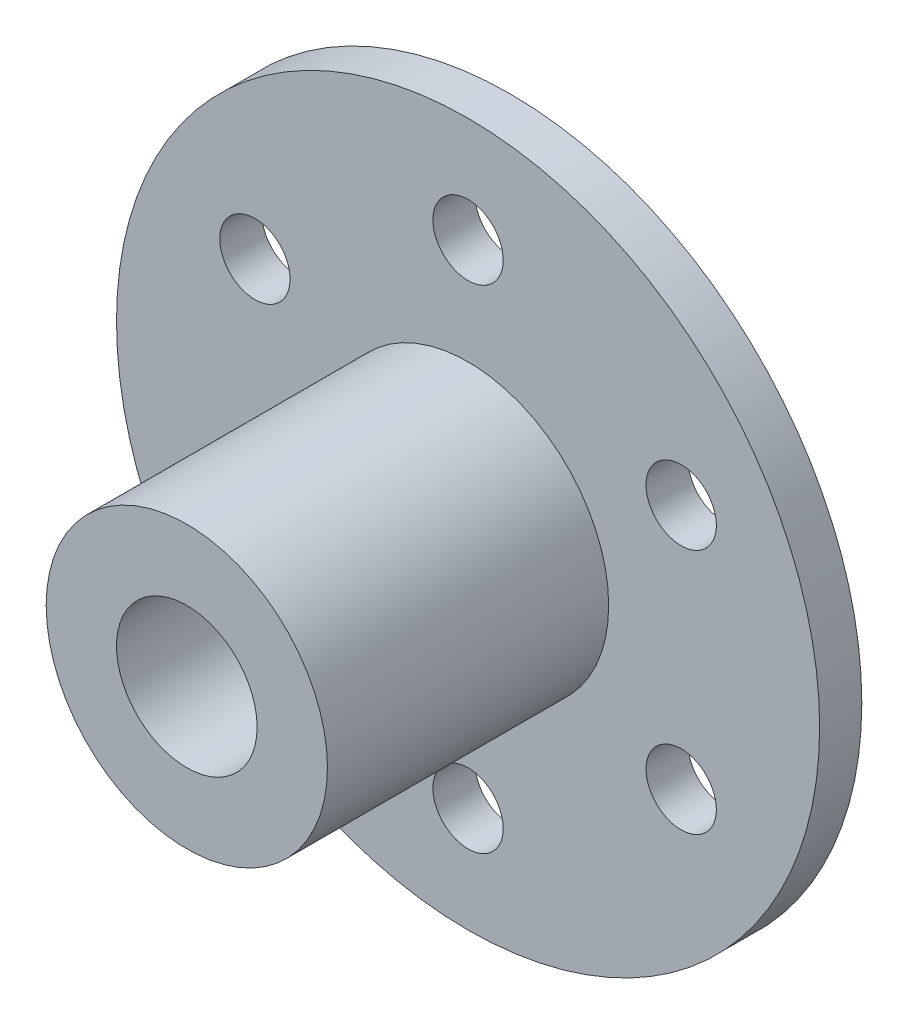
ISO-10303-21;
HEADER;
FILE_DESCRIPTION(('STEP AP214'),'2;1');
FILE_NAME('part.step','',(''),(''),'','','');
FILE_SCHEMA(('AUTOMOTIVE_DESIGN { 1 0 10303 214 1 1 1 1 }'));
ENDSEC;
DATA;
#1=APPLICATION_CONTEXT('core data for automotive mechanical design processes');
#2=APPLICATION_PROTOCOL_DEFINITION('international standard','automotive_design',2000,#1);
#3=PRODUCT_CONTEXT('',#1,'mechanical');
#4=PRODUCT('Part','Part','',(#3));
#5=PRODUCT_RELATED_PRODUCT_CATEGORY('part','',(#4));
#6=PRODUCT_DEFINITION_FORMATION('','',#4);
#7=PRODUCT_DEFINITION_CONTEXT('part definition',#1,'design');
#8=PRODUCT_DEFINITION('design','',#6,#7);
#9=PRODUCT_DEFINITION_SHAPE('','',#8);
#10=(LENGTH_UNIT() NAMED_UNIT(*) SI_UNIT(.MILLI.,.METRE.));
#11=(NAMED_UNIT(*) PLANE_ANGLE_UNIT() SI_UNIT($,.RADIAN.));
#12=(NAMED_UNIT(*) SI_UNIT($,.STERADIAN.) SOLID_ANGLE_UNIT());
#13=UNCERTAINTY_MEASURE_WITH_UNIT(LENGTH_MEASURE(1.E-05),#10,'distance_accuracy_value','');
#14=(GEOMETRIC_REPRESENTATION_CONTEXT(3) GLOBAL_UNCERTAINTY_ASSIGNED_CONTEXT((#13)) GLOBAL_UNIT_ASSIGNED_CONTEXT((#10,
#11,#12)) REPRESENTATION_CONTEXT('',''));
#15=CARTESIAN_POINT('',(0.,0.,0.));
#16=DIRECTION('',(0.,0.,1.));
#17=DIRECTION('',(1.,0.,0.));
#18=AXIS2_PLACEMENT_3D('',#15,#16,#17);
#19=CARTESIAN_POINT('',(0.,0.,40.));
#20=DIRECTION('',(0.,0.,-1.));
#21=DIRECTION('',(-1.,0.,0.));
#22=AXIS2_PLACEMENT_3D('',#19,#20,#21);
#23=CYLINDRICAL_SURFACE('',#22,10.);
#24=CARTESIAN_POINT('',(0.,0.,40.));
#25=DIRECTION('',(0.,0.,1.));
#26=DIRECTION('',(1.,0.,0.));
#27=AXIS2_PLACEMENT_3D('',#24,#25,#26);
#28=CIRCLE('',#27,10.);
#29=CARTESIAN_POINT('',(10.,0.,40.));
#30=VERTEX_POINT('',#29);
#31=EDGE_CURVE('E54',#30,#30,#28,.T.);
#32=ORIENTED_EDGE('',*,*,#31,.T.);
#33=EDGE_LOOP('',(#32));
#34=FACE_BOUND('',#33,.T.);
#35=CARTESIAN_POINT('',(0.,0.,0.));
#36=DIRECTION('',(0.,0.,1.));
#37=DIRECTION('',(1.,0.,0.));
#38=AXIS2_PLACEMENT_3D('',#35,#36,#37);
#39=CIRCLE('',#38,10.);
#40=CARTESIAN_POINT('',(10.,0.,0.));
#41=VERTEX_POINT('',#40);
#42=EDGE_CURVE('E60',#41,#41,#39,.T.);
#43=ORIENTED_EDGE('',*,*,#42,.F.);
#44=EDGE_LOOP('',(#43));
#45=FACE_BOUND('',#44,.T.);
#46=ADVANCED_FACE('F47',(#34,#45),#23,.F.);
#47=CARTESIAN_POINT('',(0.,0.,40.));
#48=DIRECTION('',(0.,0.,-1.));
#49=DIRECTION('',(-1.,0.,0.));
#50=AXIS2_PLACEMENT_3D('',#47,#48,#49);
#51=CYLINDRICAL_SURFACE('',#50,20.);
#52=CARTESIAN_POINT('',(0.,0.,40.));
#53=DIRECTION('',(0.,0.,1.));
#54=DIRECTION('',(1.,0.,0.));
#55=AXIS2_PLACEMENT_3D('',#52,#53,#54);
#56=CIRCLE('',#55,20.);
#57=CARTESIAN_POINT('',(20.,0.,40.));
#58=VERTEX_POINT('',#57);
#59=EDGE_CURVE('E11',#58,#58,#56,.T.);
#60=ORIENTED_EDGE('',*,*,#59,.F.);
#61=EDGE_LOOP('',(#60));
#62=FACE_BOUND('',#61,.T.);
#63=CARTESIAN_POINT('',(0.,0.,0.));
#64=DIRECTION('',(0.,0.,1.));
#65=DIRECTION('',(1.,0.,0.));
#66=AXIS2_PLACEMENT_3D('',#63,#64,#65);
#67=CIRCLE('',#66,20.);
#68=CARTESIAN_POINT('',(20.,0.,0.));
#69=VERTEX_POINT('',#68);
#70=EDGE_CURVE('E50',#69,#69,#67,.T.);
#71=ORIENTED_EDGE('',*,*,#70,.T.);
#72=EDGE_LOOP('',(#71));
#73=FACE_BOUND('',#72,.T.);
#74=ADVANCED_FACE('F67',(#62,#73),#51,.T.);
#75=CARTESIAN_POINT('',(0.,0.,40.));
#76=DIRECTION('',(0.,0.,1.));
#77=DIRECTION('',(1.,0.,0.));
#78=AXIS2_PLACEMENT_3D('',#75,#76,#77);
#79=PLANE('',#78);
#80=ORIENTED_EDGE('',*,*,#31,.F.);
#81=EDGE_LOOP('',(#80));
#82=FACE_BOUND('',#81,.T.);
#83=ORIENTED_EDGE('',*,*,#59,.T.);
#84=EDGE_LOOP('',(#83));
#85=FACE_BOUND('',#84,.T.);
#86=ADVANCED_FACE('F71',(#82,#85),#79,.T.);
#87=CARTESIAN_POINT('',(0.,0.,0.));
#88=DIRECTION('',(0.,0.,1.));
#89=DIRECTION('',(1.,0.,0.));
#90=AXIS2_PLACEMENT_3D('',#87,#88,#89);
#91=PLANE('',#90);
#92=ORIENTED_EDGE('',*,*,#42,.T.);
#93=EDGE_LOOP('',(#92));
#94=FACE_BOUND('',#93,.T.);
#95=ORIENTED_EDGE('',*,*,#70,.F.);
#96=EDGE_LOOP('',(#95));
#97=FACE_BOUND('',#96,.T.);
#98=ADVANCED_FACE('F69',(#94,#97),#91,.F.);
#99=CLOSED_SHELL('',(#46,#74,#86,#98));
#100=MANIFOLD_SOLID_BREP('B2',#99);
#101=CARTESIAN_POINT('',(0.,0.,-6.));
#102=DIRECTION('',(0.,0.,1.));
#103=DIRECTION('',(1.,0.,0.));
#104=AXIS2_PLACEMENT_3D('',#101,#102,#103);
#105=CYLINDRICAL_SURFACE('',#104,50.);
#106=CARTESIAN_POINT('',(0.,0.,-6.));
#107=DIRECTION('',(0.,0.,1.));
#108=DIRECTION('',(1.,0.,0.));
#109=AXIS2_PLACEMENT_3D('',#106,#107,#108);
#110=CIRCLE('',#109,50.);
#111=CARTESIAN_POINT('',(50.,0.,-6.));
#112=VERTEX_POINT('',#111);
#113=EDGE_CURVE('E124',#112,#112,#110,.T.);
#114=ORIENTED_EDGE('',*,*,#113,.T.);
#115=EDGE_LOOP('',(#114));
#116=FACE_BOUND('',#115,.T.);
#117=CARTESIAN_POINT('',(0.,0.,0.));
#118=DIRECTION('',(0.,0.,1.));
#119=DIRECTION('',(1.,0.,0.));
#120=AXIS2_PLACEMENT_3D('',#117,#118,#119);
#121=CIRCLE('',#120,50.);
#122=CARTESIAN_POINT('',(50.,0.,0.));
#123=VERTEX_POINT('',#122);
#124=EDGE_CURVE('E131',#123,#123,#121,.T.);
#125=ORIENTED_EDGE('',*,*,#124,.F.);
#126=EDGE_LOOP('',(#125));
#127=FACE_BOUND('',#126,.T.);
#128=ADVANCED_FACE('F117',(#116,#127),#105,.T.);
#129=CARTESIAN_POINT('',(0.,0.,-6.));
#130=DIRECTION('',(0.,0.,1.));
#131=DIRECTION('',(1.,0.,0.));
#132=AXIS2_PLACEMENT_3D('',#129,#130,#131);
#133=CYLINDRICAL_SURFACE('',#132,10.);
#134=CARTESIAN_POINT('',(0.,0.,-6.));
#135=DIRECTION('',(0.,0.,1.));
#136=DIRECTION('',(1.,0.,0.));
#137=AXIS2_PLACEMENT_3D('',#134,#135,#136);
#138=CIRCLE('',#137,10.);
#139=CARTESIAN_POINT('',(10.,0.,-6.));
#140=VERTEX_POINT('',#139);
#141=EDGE_CURVE('E46',#140,#140,#138,.T.);
#142=ORIENTED_EDGE('',*,*,#141,.F.);
#143=EDGE_LOOP('',(#142));
#144=FACE_BOUND('',#143,.T.);
#145=CARTESIAN_POINT('',(0.,0.,0.));
#146=DIRECTION('',(0.,0.,1.));
#147=DIRECTION('',(1.,0.,0.));
#148=AXIS2_PLACEMENT_3D('',#145,#146,#147);
#149=CIRCLE('',#148,10.);
#150=CARTESIAN_POINT('',(10.,0.,0.));
#151=VERTEX_POINT('',#150);
#152=EDGE_CURVE('E120',#151,#151,#149,.T.);
#153=ORIENTED_EDGE('',*,*,#152,.T.);
#154=EDGE_LOOP('',(#153));
#155=FACE_BOUND('',#154,.T.);
#156=ADVANCED_FACE('F198',(#144,#155),#133,.F.);
#157=CARTESIAN_POINT('',(0.,0.,-6.));
#158=DIRECTION('',(0.,0.,1.));
#159=DIRECTION('',(1.,0.,0.));
#160=AXIS2_PLACEMENT_3D('',#157,#158,#159);
#161=PLANE('',#160);
#162=CARTESIAN_POINT('',(30.3108891324552,17.5000000000004,-6.));
#163=DIRECTION('',(0.,0.,1.));
#164=DIRECTION('',(0.50000000000001,-0.866025403784433,0.));
#165=AXIS2_PLACEMENT_3D('',#162,#163,#164);
#166=CIRCLE('',#165,5.);
#167=CARTESIAN_POINT('',(32.8108891324552,13.1698729810782,-6.));
#168=VERTEX_POINT('',#167);
#169=EDGE_CURVE('E154',#168,#168,#166,.T.);
#170=ORIENTED_EDGE('',*,*,#169,.T.);
#171=EDGE_LOOP('',(#170));
#172=FACE_BOUND('',#171,.T.);
#173=CARTESIAN_POINT('',(30.3108891324555,-17.4999999999997,-6.));
#174=DIRECTION('',(0.,0.,1.));
#175=DIRECTION('',(-0.499999999999992,-0.866025403784443,0.));
#176=AXIS2_PLACEMENT_3D('',#173,#174,#175);
#177=CIRCLE('',#176,5.);
#178=CARTESIAN_POINT('',(27.8108891324556,-21.8301270189219,-6.));
#179=VERTEX_POINT('',#178);
#180=EDGE_CURVE('E160',#179,#179,#177,.T.);
#181=ORIENTED_EDGE('',*,*,#180,.T.);
#182=EDGE_LOOP('',(#181));
#183=FACE_BOUND('',#182,.T.);
#184=CARTESIAN_POINT('',(0.,-35.,-6.));
#185=DIRECTION('',(0.,0.,1.));
#186=DIRECTION('',(-1.,0.,0.));
#187=AXIS2_PLACEMENT_3D('',#184,#185,#186);
#188=CIRCLE('',#187,5.);
#189=CARTESIAN_POINT('',(-5.,-35.,-6.));
#190=VERTEX_POINT('',#189);
#191=EDGE_CURVE('E166',#190,#190,#188,.T.);
#192=ORIENTED_EDGE('',*,*,#191,.T.);
#193=EDGE_LOOP('',(#192));
#194=FACE_BOUND('',#193,.T.);
#195=CARTESIAN_POINT('',(-30.3108891324553,-17.5000000000001,-6.));
#196=DIRECTION('',(0.,0.,1.));
#197=DIRECTION('',(-0.500000000000004,0.866025403784436,0.));
#198=AXIS2_PLACEMENT_3D('',#195,#196,#197);
#199=CIRCLE('',#198,5.);
#200=CARTESIAN_POINT('',(-32.8108891324553,-13.169872981078,-6.));
#201=VERTEX_POINT('',#200);
#202=EDGE_CURVE('E148',#201,#201,#199,.T.);
#203=ORIENTED_EDGE('',*,*,#202,.T.);
#204=EDGE_LOOP('',(#203));
#205=FACE_BOUND('',#204,.T.);
#206=CARTESIAN_POINT('',(-30.3108891324554,17.4999999999999,-6.));
#207=DIRECTION('',(0.,0.,1.));
#208=DIRECTION('',(0.499999999999998,0.86602540378444,0.));
#209=AXIS2_PLACEMENT_3D('',#206,#207,#208);
#210=CIRCLE('',#209,5.);
#211=CARTESIAN_POINT('',(-27.8108891324554,21.8301270189221,-6.));
#212=VERTEX_POINT('',#211);
#213=EDGE_CURVE('E143',#212,#212,#210,.T.);
#214=ORIENTED_EDGE('',*,*,#213,.T.);
#215=EDGE_LOOP('',(#214));
#216=FACE_BOUND('',#215,.T.);
#217=CARTESIAN_POINT('',(0.,35.,-6.));
#218=DIRECTION('',(0.,0.,1.));
#219=DIRECTION('',(1.,0.,0.));
#220=AXIS2_PLACEMENT_3D('',#217,#218,#219);
#221=CIRCLE('',#220,5.);
#222=CARTESIAN_POINT('',(5.,35.,-6.));
#223=VERTEX_POINT('',#222);
#224=EDGE_CURVE('E133',#223,#223,#221,.T.);
#225=ORIENTED_EDGE('',*,*,#224,.T.);
#226=EDGE_LOOP('',(#225));
#227=FACE_BOUND('',#226,.T.);
#228=ORIENTED_EDGE('',*,*,#113,.F.);
#229=EDGE_LOOP('',(#228));
#230=FACE_BOUND('',#229,.T.);
#231=ORIENTED_EDGE('',*,*,#141,.T.);
#232=EDGE_LOOP('',(#231));
#233=FACE_BOUND('',#232,.T.);
#234=ADVANCED_FACE('F175',(#172,#183,#194,#205,#216,#227,#230,#233),#161,.F.);
#235=CARTESIAN_POINT('',(0.,0.,0.));
#236=DIRECTION('',(0.,0.,1.));
#237=DIRECTION('',(1.,0.,0.));
#238=AXIS2_PLACEMENT_3D('',#235,#236,#237);
#239=PLANE('',#238);
#240=CARTESIAN_POINT('',(30.3108891324552,17.5000000000004,0.));
#241=DIRECTION('',(0.,0.,1.));
#242=DIRECTION('',(0.50000000000001,-0.866025403784433,0.));
#243=AXIS2_PLACEMENT_3D('',#240,#241,#242);
#244=CIRCLE('',#243,5.);
#245=CARTESIAN_POINT('',(32.8108891324552,13.1698729810782,0.));
#246=VERTEX_POINT('',#245);
#247=EDGE_CURVE('E151',#246,#246,#244,.T.);
#248=ORIENTED_EDGE('',*,*,#247,.F.);
#249=EDGE_LOOP('',(#248));
#250=FACE_BOUND('',#249,.T.);
#251=CARTESIAN_POINT('',(30.3108891324555,-17.4999999999997,0.));
#252=DIRECTION('',(0.,0.,1.));
#253=DIRECTION('',(-0.499999999999992,-0.866025403784443,0.));
#254=AXIS2_PLACEMENT_3D('',#251,#252,#253);
#255=CIRCLE('',#254,5.);
#256=CARTESIAN_POINT('',(27.8108891324556,-21.8301270189219,0.));
#257=VERTEX_POINT('',#256);
#258=EDGE_CURVE('E157',#257,#257,#255,.T.);
#259=ORIENTED_EDGE('',*,*,#258,.F.);
#260=EDGE_LOOP('',(#259));
#261=FACE_BOUND('',#260,.T.);
#262=CARTESIAN_POINT('',(0.,-35.,0.));
#263=DIRECTION('',(0.,0.,1.));
#264=DIRECTION('',(-1.,0.,0.));
#265=AXIS2_PLACEMENT_3D('',#262,#263,#264);
#266=CIRCLE('',#265,5.);
#267=CARTESIAN_POINT('',(-5.,-35.,0.));
#268=VERTEX_POINT('',#267);
#269=EDGE_CURVE('E163',#268,#268,#266,.T.);
#270=ORIENTED_EDGE('',*,*,#269,.F.);
#271=EDGE_LOOP('',(#270));
#272=FACE_BOUND('',#271,.T.);
#273=CARTESIAN_POINT('',(-30.3108891324553,-17.5000000000001,0.));
#274=DIRECTION('',(0.,0.,1.));
#275=DIRECTION('',(-0.500000000000004,0.866025403784436,0.));
#276=AXIS2_PLACEMENT_3D('',#273,#274,#275);
#277=CIRCLE('',#276,5.);
#278=CARTESIAN_POINT('',(-32.8108891324553,-13.169872981078,0.));
#279=VERTEX_POINT('',#278);
#280=EDGE_CURVE('E169',#279,#279,#277,.T.);
#281=ORIENTED_EDGE('',*,*,#280,.F.);
#282=EDGE_LOOP('',(#281));
#283=FACE_BOUND('',#282,.T.);
#284=CARTESIAN_POINT('',(-30.3108891324554,17.4999999999999,0.));
#285=DIRECTION('',(0.,0.,1.));
#286=DIRECTION('',(0.499999999999998,0.86602540378444,0.));
#287=AXIS2_PLACEMENT_3D('',#284,#285,#286);
#288=CIRCLE('',#287,5.);
#289=CARTESIAN_POINT('',(-27.8108891324554,21.8301270189221,0.));
#290=VERTEX_POINT('',#289);
#291=EDGE_CURVE('E145',#290,#290,#288,.T.);
#292=ORIENTED_EDGE('',*,*,#291,.F.);
#293=EDGE_LOOP('',(#292));
#294=FACE_BOUND('',#293,.T.);
#295=CARTESIAN_POINT('',(0.,35.,0.));
#296=DIRECTION('',(0.,0.,1.));
#297=DIRECTION('',(1.,0.,0.));
#298=AXIS2_PLACEMENT_3D('',#295,#296,#297);
#299=CIRCLE('',#298,5.);
#300=CARTESIAN_POINT('',(5.,35.,0.));
#301=VERTEX_POINT('',#300);
#302=EDGE_CURVE('E138',#301,#301,#299,.T.);
#303=ORIENTED_EDGE('',*,*,#302,.F.);
#304=EDGE_LOOP('',(#303));
#305=FACE_BOUND('',#304,.T.);
#306=ORIENTED_EDGE('',*,*,#124,.T.);
#307=EDGE_LOOP('',(#306));
#308=FACE_BOUND('',#307,.T.);
#309=ORIENTED_EDGE('',*,*,#152,.F.);
#310=EDGE_LOOP('',(#309));
#311=FACE_BOUND('',#310,.T.);
#312=ADVANCED_FACE('F186',(#250,#261,#272,#283,#294,#305,#308,#311),#239,.T.);
#313=CARTESIAN_POINT('',(0.,35.,-6.));
#314=DIRECTION('',(0.,0.,1.));
#315=DIRECTION('',(1.,0.,0.));
#316=AXIS2_PLACEMENT_3D('',#313,#314,#315);
#317=CYLINDRICAL_SURFACE('',#316,5.);
#318=ORIENTED_EDGE('',*,*,#224,.F.);
#319=EDGE_LOOP('',(#318));
#320=FACE_BOUND('',#319,.T.);
#321=ORIENTED_EDGE('',*,*,#302,.T.);
#322=EDGE_LOOP('',(#321));
#323=FACE_BOUND('',#322,.T.);
#324=ADVANCED_FACE('F189',(#320,#323),#317,.F.);
#325=CARTESIAN_POINT('',(-30.3108891324554,17.4999999999999,-6.));
#326=DIRECTION('',(0.,0.,1.));
#327=DIRECTION('',(1.,0.,0.));
#328=AXIS2_PLACEMENT_3D('',#325,#326,#327);
#329=CYLINDRICAL_SURFACE('',#328,5.);
#330=ORIENTED_EDGE('',*,*,#213,.F.);
#331=EDGE_LOOP('',(#330));
#332=FACE_BOUND('',#331,.T.);
#333=ORIENTED_EDGE('',*,*,#291,.T.);
#334=EDGE_LOOP('',(#333));
#335=FACE_BOUND('',#334,.T.);
#336=ADVANCED_FACE('F182',(#332,#335),#329,.F.);
#337=CARTESIAN_POINT('',(-30.3108891324553,-17.5000000000001,-6.));
#338=DIRECTION('',(0.,0.,1.));
#339=DIRECTION('',(1.,0.,0.));
#340=AXIS2_PLACEMENT_3D('',#337,#338,#339);
#341=CYLINDRICAL_SURFACE('',#340,5.);
#342=ORIENTED_EDGE('',*,*,#202,.F.);
#343=EDGE_LOOP('',(#342));
#344=FACE_BOUND('',#343,.T.);
#345=ORIENTED_EDGE('',*,*,#280,.T.);
#346=EDGE_LOOP('',(#345));
#347=FACE_BOUND('',#346,.T.);
#348=ADVANCED_FACE('F178',(#344,#347),#341,.F.);
#349=CARTESIAN_POINT('',(0.,-35.,-6.));
#350=DIRECTION('',(0.,0.,1.));
#351=DIRECTION('',(1.,0.,0.));
#352=AXIS2_PLACEMENT_3D('',#349,#350,#351);
#353=CYLINDRICAL_SURFACE('',#352,5.);
#354=ORIENTED_EDGE('',*,*,#191,.F.);
#355=EDGE_LOOP('',(#354));
#356=FACE_BOUND('',#355,.T.);
#357=ORIENTED_EDGE('',*,*,#269,.T.);
#358=EDGE_LOOP('',(#357));
#359=FACE_BOUND('',#358,.T.);
#360=ADVANCED_FACE('F181',(#356,#359),#353,.F.);
#361=CARTESIAN_POINT('',(30.3108891324555,-17.4999999999997,-6.));
#362=DIRECTION('',(0.,0.,1.));
#363=DIRECTION('',(1.,0.,0.));
#364=AXIS2_PLACEMENT_3D('',#361,#362,#363);
#365=CYLINDRICAL_SURFACE('',#364,5.);
#366=ORIENTED_EDGE('',*,*,#180,.F.);
#367=EDGE_LOOP('',(#366));
#368=FACE_BOUND('',#367,.T.);
#369=ORIENTED_EDGE('',*,*,#258,.T.);
#370=EDGE_LOOP('',(#369));
#371=FACE_BOUND('',#370,.T.);
#372=ADVANCED_FACE('F218',(#368,#371),#365,.F.);
#373=CARTESIAN_POINT('',(30.3108891324552,17.5000000000004,-6.));
#374=DIRECTION('',(0.,0.,1.));
#375=DIRECTION('',(1.,0.,0.));
#376=AXIS2_PLACEMENT_3D('',#373,#374,#375);
#377=CYLINDRICAL_SURFACE('',#376,5.);
#378=ORIENTED_EDGE('',*,*,#169,.F.);
#379=EDGE_LOOP('',(#378));
#380=FACE_BOUND('',#379,.T.);
#381=ORIENTED_EDGE('',*,*,#247,.T.);
#382=EDGE_LOOP('',(#381));
#383=FACE_BOUND('',#382,.T.);
#384=ADVANCED_FACE('F215',(#380,#383),#377,.F.);
#385=CLOSED_SHELL('',(#128,#156,#234,#312,#324,#336,#348,#360,#372,#384));
#386=MANIFOLD_SOLID_BREP('B6',#385);
#387=ADVANCED_BREP_SHAPE_REPRESENTATION('',(#18,#100,#386),#14);
#388=SHAPE_DEFINITION_REPRESENTATION(#9,#387);
ENDSEC;
END-ISO-10303-21;
